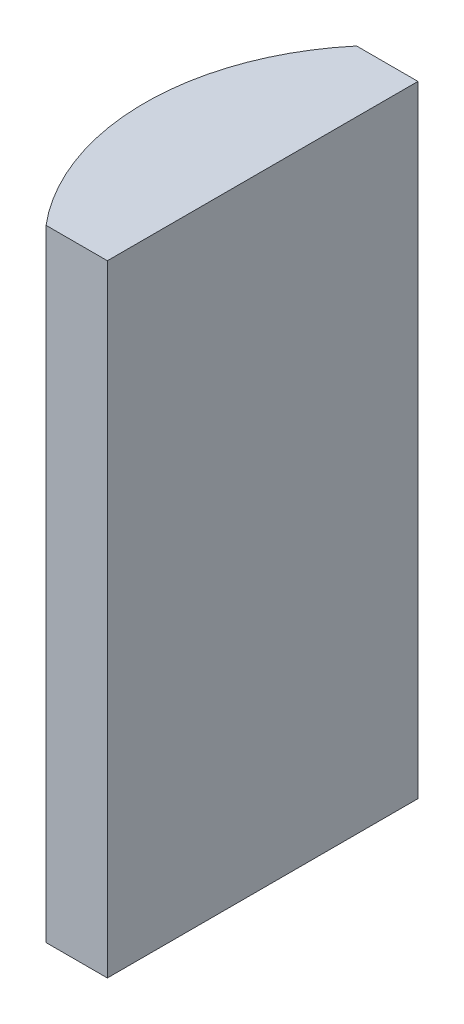
ISO-10303-21;
HEADER;
FILE_DESCRIPTION(('STEP AP214'),'2;1');
FILE_NAME('part.step','',(''),(''),'','','');
FILE_SCHEMA(('AUTOMOTIVE_DESIGN { 1 0 10303 214 1 1 1 1 }'));
ENDSEC;
DATA;
#1=APPLICATION_CONTEXT('core data for automotive mechanical design processes');
#2=APPLICATION_PROTOCOL_DEFINITION('international standard','automotive_design',2000,#1);
#3=PRODUCT_CONTEXT('',#1,'mechanical');
#4=PRODUCT('Part','Part','',(#3));
#5=PRODUCT_RELATED_PRODUCT_CATEGORY('part','',(#4));
#6=PRODUCT_DEFINITION_FORMATION('','',#4);
#7=PRODUCT_DEFINITION_CONTEXT('part definition',#1,'design');
#8=PRODUCT_DEFINITION('design','',#6,#7);
#9=PRODUCT_DEFINITION_SHAPE('','',#8);
#10=(LENGTH_UNIT() NAMED_UNIT(*) SI_UNIT(.MILLI.,.METRE.));
#11=(NAMED_UNIT(*) PLANE_ANGLE_UNIT() SI_UNIT($,.RADIAN.));
#12=(NAMED_UNIT(*) SI_UNIT($,.STERADIAN.) SOLID_ANGLE_UNIT());
#13=UNCERTAINTY_MEASURE_WITH_UNIT(LENGTH_MEASURE(1.E-05),#10,'distance_accuracy_value','');
#14=(GEOMETRIC_REPRESENTATION_CONTEXT(3) GLOBAL_UNCERTAINTY_ASSIGNED_CONTEXT((#13)) GLOBAL_UNIT_ASSIGNED_CONTEXT((#10,
#11,#12)) REPRESENTATION_CONTEXT('',''));
#15=CARTESIAN_POINT('',(0.,0.,0.));
#16=DIRECTION('',(0.,0.,1.));
#17=DIRECTION('',(1.,0.,0.));
#18=AXIS2_PLACEMENT_3D('',#15,#16,#17);
#19=CARTESIAN_POINT('',(4.35520433485127,20.,0.));
#20=DIRECTION('',(0.,-1.,0.));
#21=DIRECTION('',(0.,0.,-1.));
#22=AXIS2_PLACEMENT_3D('',#19,#20,#21);
#23=CYLINDRICAL_SURFACE('',#22,7.76);
#24=CARTESIAN_POINT('',(4.35520433485127,0.,0.));
#25=DIRECTION('',(0.,1.,0.));
#26=DIRECTION('',(0.,0.,1.));
#27=AXIS2_PLACEMENT_3D('',#24,#25,#26);
#28=CIRCLE('',#27,7.76);
#29=CARTESIAN_POINT('',(-1.57923750916406,0.,-5.));
#30=VERTEX_POINT('',#29);
#31=CARTESIAN_POINT('',(-1.57923750916406,0.,5.));
#32=VERTEX_POINT('',#31);
#33=EDGE_CURVE('E100',#30,#32,#28,.T.);
#34=ORIENTED_EDGE('',*,*,#33,.T.);
#35=DIRECTION('',(0.,-1.,0.));
#36=VECTOR('',#35,1.);
#37=CARTESIAN_POINT('',(-1.57923750916406,20.,5.));
#38=LINE('',#37,#36);
#39=CARTESIAN_POINT('',(-1.57923750916406,20.,5.));
#40=VERTEX_POINT('',#39);
#41=EDGE_CURVE('E11',#40,#32,#38,.T.);
#42=ORIENTED_EDGE('',*,*,#41,.F.);
#43=CARTESIAN_POINT('',(4.35520433485127,20.,0.));
#44=DIRECTION('',(0.,1.,0.));
#45=DIRECTION('',(0.,0.,1.));
#46=AXIS2_PLACEMENT_3D('',#43,#44,#45);
#47=CIRCLE('',#46,7.76);
#48=CARTESIAN_POINT('',(-1.57923750916406,20.,-5.));
#49=VERTEX_POINT('',#48);
#50=EDGE_CURVE('E88',#49,#40,#47,.T.);
#51=ORIENTED_EDGE('',*,*,#50,.F.);
#52=DIRECTION('',(0.,-1.,0.));
#53=VECTOR('',#52,1.);
#54=CARTESIAN_POINT('',(-1.57923750916406,20.,-5.));
#55=LINE('',#54,#53);
#56=EDGE_CURVE('E96',#49,#30,#55,.T.);
#57=ORIENTED_EDGE('',*,*,#56,.T.);
#58=EDGE_LOOP('',(#34,#42,#51,#57));
#59=FACE_BOUND('',#58,.T.);
#60=ADVANCED_FACE('F37',(#59),#23,.T.);
#61=CARTESIAN_POINT('',(-1.57923750916406,20.,5.));
#62=DIRECTION('',(0.,0.,-1.));
#63=DIRECTION('',(-1.,0.,0.));
#64=AXIS2_PLACEMENT_3D('',#61,#62,#63);
#65=PLANE('',#64);
#66=DIRECTION('',(1.,0.,0.));
#67=VECTOR('',#66,1.);
#68=CARTESIAN_POINT('',(-1.57923750916406,0.,5.));
#69=LINE('',#68,#67);
#70=CARTESIAN_POINT('',(0.395204334851266,0.,5.));
#71=VERTEX_POINT('',#70);
#72=EDGE_CURVE('E92',#32,#71,#69,.T.);
#73=ORIENTED_EDGE('',*,*,#72,.T.);
#74=DIRECTION('',(0.,-1.,0.));
#75=VECTOR('',#74,1.);
#76=CARTESIAN_POINT('',(0.395204334851266,20.,5.));
#77=LINE('',#76,#75);
#78=CARTESIAN_POINT('',(0.395204334851266,20.,5.));
#79=VERTEX_POINT('',#78);
#80=EDGE_CURVE('E45',#79,#71,#77,.T.);
#81=ORIENTED_EDGE('',*,*,#80,.F.);
#82=DIRECTION('',(1.,0.,0.));
#83=VECTOR('',#82,1.);
#84=CARTESIAN_POINT('',(-1.57923750916406,20.,5.));
#85=LINE('',#84,#83);
#86=EDGE_CURVE('E83',#40,#79,#85,.T.);
#87=ORIENTED_EDGE('',*,*,#86,.F.);
#88=ORIENTED_EDGE('',*,*,#41,.T.);
#89=EDGE_LOOP('',(#73,#81,#87,#88));
#90=FACE_BOUND('',#89,.T.);
#91=ADVANCED_FACE('F91',(#90),#65,.F.);
#92=CARTESIAN_POINT('',(0.395204334851263,20.,-5.));
#93=DIRECTION('',(-1.,0.,0.));
#94=DIRECTION('',(0.,0.,1.));
#95=AXIS2_PLACEMENT_3D('',#92,#93,#94);
#96=PLANE('',#95);
#97=DIRECTION('',(0.,0.,-1.));
#98=VECTOR('',#97,1.);
#99=CARTESIAN_POINT('',(0.395204334851263,0.,-5.));
#100=LINE('',#99,#98);
#101=CARTESIAN_POINT('',(0.395204334851263,0.,-5.));
#102=VERTEX_POINT('',#101);
#103=EDGE_CURVE('E70',#71,#102,#100,.T.);
#104=ORIENTED_EDGE('',*,*,#103,.T.);
#105=DIRECTION('',(0.,-1.,0.));
#106=VECTOR('',#105,1.);
#107=CARTESIAN_POINT('',(0.395204334851263,20.,-5.));
#108=LINE('',#107,#106);
#109=CARTESIAN_POINT('',(0.395204334851263,20.,-5.));
#110=VERTEX_POINT('',#109);
#111=EDGE_CURVE('E93',#110,#102,#108,.T.);
#112=ORIENTED_EDGE('',*,*,#111,.F.);
#113=DIRECTION('',(0.,0.,-1.));
#114=VECTOR('',#113,1.);
#115=CARTESIAN_POINT('',(0.395204334851263,20.,-5.));
#116=LINE('',#115,#114);
#117=EDGE_CURVE('E86',#79,#110,#116,.T.);
#118=ORIENTED_EDGE('',*,*,#117,.F.);
#119=ORIENTED_EDGE('',*,*,#80,.T.);
#120=EDGE_LOOP('',(#104,#112,#118,#119));
#121=FACE_BOUND('',#120,.T.);
#122=ADVANCED_FACE('F94',(#121),#96,.F.);
#123=CARTESIAN_POINT('',(-1.57923750916406,20.,-5.));
#124=DIRECTION('',(0.,0.,1.));
#125=DIRECTION('',(1.,0.,0.));
#126=AXIS2_PLACEMENT_3D('',#123,#124,#125);
#127=PLANE('',#126);
#128=DIRECTION('',(-1.,0.,0.));
#129=VECTOR('',#128,1.);
#130=CARTESIAN_POINT('',(-1.57923750916406,0.,-5.));
#131=LINE('',#130,#129);
#132=EDGE_CURVE('E76',#102,#30,#131,.T.);
#133=ORIENTED_EDGE('',*,*,#132,.T.);
#134=ORIENTED_EDGE('',*,*,#56,.F.);
#135=DIRECTION('',(-1.,0.,0.));
#136=VECTOR('',#135,1.);
#137=CARTESIAN_POINT('',(-1.57923750916406,20.,-5.));
#138=LINE('',#137,#136);
#139=EDGE_CURVE('E53',#110,#49,#138,.T.);
#140=ORIENTED_EDGE('',*,*,#139,.F.);
#141=ORIENTED_EDGE('',*,*,#111,.T.);
#142=EDGE_LOOP('',(#133,#134,#140,#141));
#143=FACE_BOUND('',#142,.T.);
#144=ADVANCED_FACE('F107',(#143),#127,.F.);
#145=CARTESIAN_POINT('',(4.35520433485127,20.,0.));
#146=DIRECTION('',(0.,1.,0.));
#147=DIRECTION('',(0.,0.,1.));
#148=AXIS2_PLACEMENT_3D('',#145,#146,#147);
#149=PLANE('',#148);
#150=ORIENTED_EDGE('',*,*,#50,.T.);
#151=ORIENTED_EDGE('',*,*,#86,.T.);
#152=ORIENTED_EDGE('',*,*,#117,.T.);
#153=ORIENTED_EDGE('',*,*,#139,.T.);
#154=EDGE_LOOP('',(#150,#151,#152,#153));
#155=FACE_BOUND('',#154,.T.);
#156=ADVANCED_FACE('F84',(#155),#149,.T.);
#157=CARTESIAN_POINT('',(4.35520433485127,0.,0.));
#158=DIRECTION('',(0.,1.,0.));
#159=DIRECTION('',(0.,0.,1.));
#160=AXIS2_PLACEMENT_3D('',#157,#158,#159);
#161=PLANE('',#160);
#162=ORIENTED_EDGE('',*,*,#33,.F.);
#163=ORIENTED_EDGE('',*,*,#132,.F.);
#164=ORIENTED_EDGE('',*,*,#103,.F.);
#165=ORIENTED_EDGE('',*,*,#72,.F.);
#166=EDGE_LOOP('',(#162,#163,#164,#165));
#167=FACE_BOUND('',#166,.T.);
#168=ADVANCED_FACE('F110',(#167),#161,.F.);
#169=CLOSED_SHELL('',(#60,#91,#122,#144,#156,#168));
#170=MANIFOLD_SOLID_BREP('B2',#169);
#171=ADVANCED_BREP_SHAPE_REPRESENTATION('',(#18,#170),#14);
#172=SHAPE_DEFINITION_REPRESENTATION(#9,#171);
ENDSEC;
END-ISO-10303-21;
